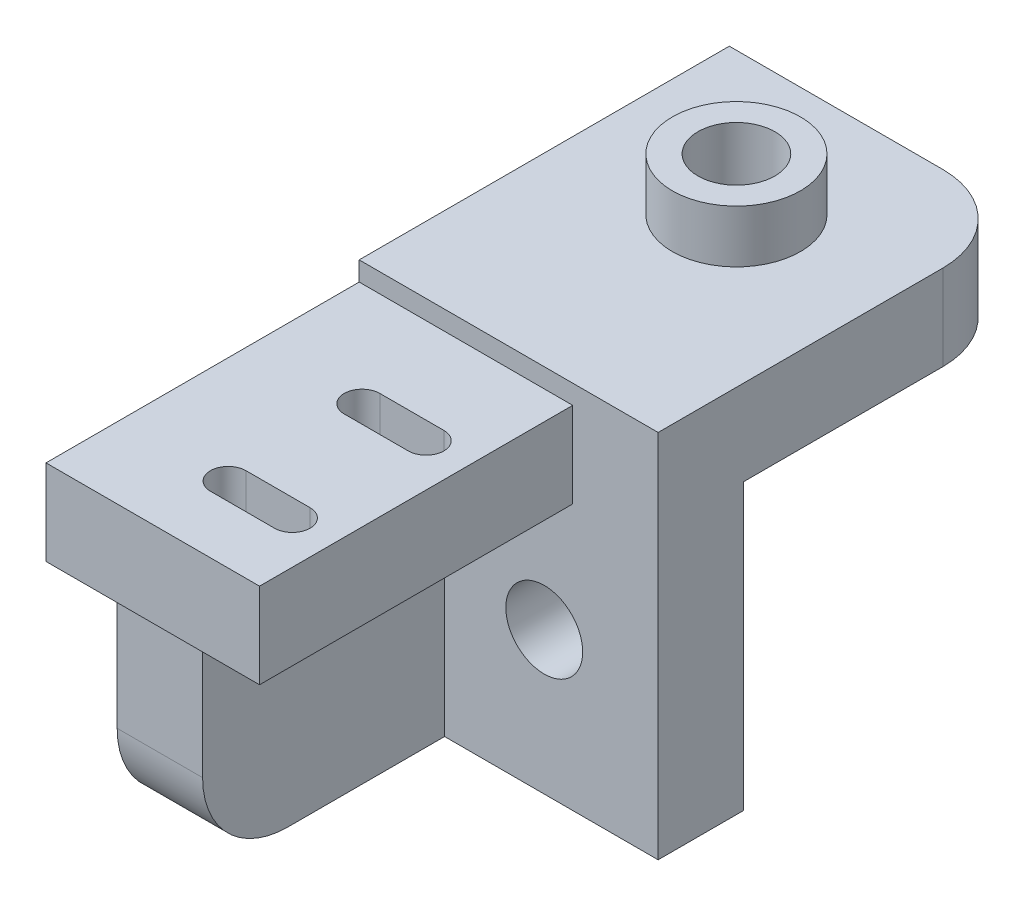
ISO-10303-21;
HEADER;
FILE_DESCRIPTION(('STEP AP214'),'2;1');
FILE_NAME('part.step','',(''),(''),'','','');
FILE_SCHEMA(('AUTOMOTIVE_DESIGN { 1 0 10303 214 1 1 1 1 }'));
ENDSEC;
DATA;
#1=APPLICATION_CONTEXT('core data for automotive mechanical design processes');
#2=APPLICATION_PROTOCOL_DEFINITION('international standard','automotive_design',2000,#1);
#3=PRODUCT_CONTEXT('',#1,'mechanical');
#4=PRODUCT('Part','Part','',(#3));
#5=PRODUCT_RELATED_PRODUCT_CATEGORY('part','',(#4));
#6=PRODUCT_DEFINITION_FORMATION('','',#4);
#7=PRODUCT_DEFINITION_CONTEXT('part definition',#1,'design');
#8=PRODUCT_DEFINITION('design','',#6,#7);
#9=PRODUCT_DEFINITION_SHAPE('','',#8);
#10=(LENGTH_UNIT() NAMED_UNIT(*) SI_UNIT(.MILLI.,.METRE.));
#11=(NAMED_UNIT(*) PLANE_ANGLE_UNIT() SI_UNIT($,.RADIAN.));
#12=(NAMED_UNIT(*) SI_UNIT($,.STERADIAN.) SOLID_ANGLE_UNIT());
#13=UNCERTAINTY_MEASURE_WITH_UNIT(LENGTH_MEASURE(1.E-05),#10,'distance_accuracy_value','');
#14=(GEOMETRIC_REPRESENTATION_CONTEXT(3) GLOBAL_UNCERTAINTY_ASSIGNED_CONTEXT((#13)) GLOBAL_UNIT_ASSIGNED_CONTEXT((#10,
#11,#12)) REPRESENTATION_CONTEXT('',''));
#15=CARTESIAN_POINT('',(0.,0.,0.));
#16=DIRECTION('',(0.,0.,1.));
#17=DIRECTION('',(1.,0.,0.));
#18=AXIS2_PLACEMENT_3D('',#15,#16,#17);
#19=CARTESIAN_POINT('',(0.,0.,6.));
#20=DIRECTION('',(0.,0.,1.));
#21=DIRECTION('',(1.,0.,0.));
#22=AXIS2_PLACEMENT_3D('',#19,#20,#21);
#23=PLANE('',#22);
#24=CARTESIAN_POINT('',(13.,10.,6.));
#25=DIRECTION('',(0.,0.,1.));
#26=DIRECTION('',(1.,0.,0.));
#27=AXIS2_PLACEMENT_3D('',#24,#25,#26);
#28=CIRCLE('',#27,2.7);
#29=CARTESIAN_POINT('',(15.7,10.,6.));
#30=VERTEX_POINT('',#29);
#31=EDGE_CURVE('E399',#30,#30,#28,.T.);
#32=ORIENTED_EDGE('',*,*,#31,.F.);
#33=EDGE_LOOP('',(#32));
#34=FACE_BOUND('',#33,.T.);
#35=DIRECTION('',(1.,0.,0.));
#36=VECTOR('',#35,1.);
#37=CARTESIAN_POINT('',(0.,18.65,6.));
#38=LINE('',#37,#36);
#39=CARTESIAN_POINT('',(6.,18.65,6.));
#40=VERTEX_POINT('',#39);
#41=CARTESIAN_POINT('',(15.,18.65,6.));
#42=VERTEX_POINT('',#41);
#43=EDGE_CURVE('E283',#40,#42,#38,.T.);
#44=ORIENTED_EDGE('',*,*,#43,.F.);
#45=DIRECTION('',(0.,1.,0.));
#46=VECTOR('',#45,1.);
#47=CARTESIAN_POINT('',(6.,0.,6.));
#48=LINE('',#47,#46);
#49=CARTESIAN_POINT('',(6.,0.,6.));
#50=VERTEX_POINT('',#49);
#51=EDGE_CURVE('E261',#50,#40,#48,.T.);
#52=ORIENTED_EDGE('',*,*,#51,.F.);
#53=DIRECTION('',(1.,0.,0.));
#54=VECTOR('',#53,1.);
#55=CARTESIAN_POINT('',(0.,0.,6.));
#56=LINE('',#55,#54);
#57=CARTESIAN_POINT('',(21.,0.,6.));
#58=VERTEX_POINT('',#57);
#59=EDGE_CURVE('E481',#50,#58,#56,.T.);
#60=ORIENTED_EDGE('',*,*,#59,.T.);
#61=DIRECTION('',(0.,1.,0.));
#62=VECTOR('',#61,1.);
#63=CARTESIAN_POINT('',(21.,0.,6.));
#64=LINE('',#63,#62);
#65=CARTESIAN_POINT('',(21.,26.,6.));
#66=VERTEX_POINT('',#65);
#67=EDGE_CURVE('E480',#58,#66,#64,.T.);
#68=ORIENTED_EDGE('',*,*,#67,.T.);
#69=DIRECTION('',(1.,0.,0.));
#70=VECTOR('',#69,1.);
#71=CARTESIAN_POINT('',(0.,26.,6.));
#72=LINE('',#71,#70);
#73=CARTESIAN_POINT('',(0.,26.,6.));
#74=VERTEX_POINT('',#73);
#75=EDGE_CURVE('E415',#74,#66,#72,.T.);
#76=ORIENTED_EDGE('',*,*,#75,.F.);
#77=DIRECTION('',(0.,1.,0.));
#78=VECTOR('',#77,1.);
#79=CARTESIAN_POINT('',(0.,0.,6.));
#80=LINE('',#79,#78);
#81=CARTESIAN_POINT('',(0.,24.65,6.));
#82=VERTEX_POINT('',#81);
#83=EDGE_CURVE('E320',#82,#74,#80,.T.);
#84=ORIENTED_EDGE('',*,*,#83,.F.);
#85=DIRECTION('',(-1.,0.,0.));
#86=VECTOR('',#85,1.);
#87=CARTESIAN_POINT('',(0.,24.65,6.));
#88=LINE('',#87,#86);
#89=CARTESIAN_POINT('',(15.,24.65,6.));
#90=VERTEX_POINT('',#89);
#91=EDGE_CURVE('E290',#90,#82,#88,.T.);
#92=ORIENTED_EDGE('',*,*,#91,.F.);
#93=DIRECTION('',(0.,1.,0.));
#94=VECTOR('',#93,1.);
#95=CARTESIAN_POINT('',(15.,24.65,6.));
#96=LINE('',#95,#94);
#97=EDGE_CURVE('E297',#42,#90,#96,.T.);
#98=ORIENTED_EDGE('',*,*,#97,.F.);
#99=EDGE_LOOP('',(#44,#52,#60,#68,#76,#84,#92,#98));
#100=FACE_BOUND('',#99,.T.);
#101=ADVANCED_FACE('F37',(#34,#100),#23,.T.);
#102=CARTESIAN_POINT('',(0.,18.65,28.));
#103=DIRECTION('',(0.,1.,0.));
#104=DIRECTION('',(0.,0.,1.));
#105=AXIS2_PLACEMENT_3D('',#102,#103,#104);
#106=PLANE('',#105);
#107=DIRECTION('',(1.,0.,0.));
#108=VECTOR('',#107,1.);
#109=CARTESIAN_POINT('',(0.,18.65,23.95));
#110=LINE('',#109,#108);
#111=CARTESIAN_POINT('',(7.5,18.65,23.95));
#112=VERTEX_POINT('',#111);
#113=CARTESIAN_POINT('',(12.,18.65,23.95));
#114=VERTEX_POINT('',#113);
#115=EDGE_CURVE('E223',#112,#114,#110,.T.);
#116=ORIENTED_EDGE('',*,*,#115,.T.);
#117=CARTESIAN_POINT('',(12.,18.65,22.7));
#118=DIRECTION('',(0.,1.,0.));
#119=DIRECTION('',(0.,0.,1.));
#120=AXIS2_PLACEMENT_3D('',#117,#118,#119);
#121=CIRCLE('',#120,1.25);
#122=CARTESIAN_POINT('',(12.,18.65,21.45));
#123=VERTEX_POINT('',#122);
#124=EDGE_CURVE('E226',#114,#123,#121,.T.);
#125=ORIENTED_EDGE('',*,*,#124,.T.);
#126=DIRECTION('',(-1.,0.,0.));
#127=VECTOR('',#126,1.);
#128=CARTESIAN_POINT('',(0.,18.65,21.45));
#129=LINE('',#128,#127);
#130=CARTESIAN_POINT('',(7.5,18.65,21.45));
#131=VERTEX_POINT('',#130);
#132=EDGE_CURVE('E218',#123,#131,#129,.T.);
#133=ORIENTED_EDGE('',*,*,#132,.T.);
#134=CARTESIAN_POINT('',(7.5,18.65,22.7));
#135=DIRECTION('',(0.,1.,0.));
#136=DIRECTION('',(0.,0.,1.));
#137=AXIS2_PLACEMENT_3D('',#134,#135,#136);
#138=CIRCLE('',#137,1.25);
#139=EDGE_CURVE('E193',#131,#112,#138,.T.);
#140=ORIENTED_EDGE('',*,*,#139,.T.);
#141=EDGE_LOOP('',(#116,#125,#133,#140));
#142=FACE_BOUND('',#141,.T.);
#143=DIRECTION('',(1.,0.,0.));
#144=VECTOR('',#143,1.);
#145=CARTESIAN_POINT('',(0.,18.65,14.55));
#146=LINE('',#145,#144);
#147=CARTESIAN_POINT('',(7.5,18.65,14.55));
#148=VERTEX_POINT('',#147);
#149=CARTESIAN_POINT('',(12.,18.65,14.55));
#150=VERTEX_POINT('',#149);
#151=EDGE_CURVE('E255',#148,#150,#146,.T.);
#152=ORIENTED_EDGE('',*,*,#151,.T.);
#153=CARTESIAN_POINT('',(12.,18.65,13.3));
#154=DIRECTION('',(0.,1.,0.));
#155=DIRECTION('',(0.,0.,1.));
#156=AXIS2_PLACEMENT_3D('',#153,#154,#155);
#157=CIRCLE('',#156,1.25);
#158=CARTESIAN_POINT('',(12.,18.65,12.05));
#159=VERTEX_POINT('',#158);
#160=EDGE_CURVE('E258',#150,#159,#157,.T.);
#161=ORIENTED_EDGE('',*,*,#160,.T.);
#162=DIRECTION('',(-1.,0.,0.));
#163=VECTOR('',#162,1.);
#164=CARTESIAN_POINT('',(0.,18.65,12.05));
#165=LINE('',#164,#163);
#166=CARTESIAN_POINT('',(7.5,18.65,12.05));
#167=VERTEX_POINT('',#166);
#168=EDGE_CURVE('E243',#159,#167,#165,.T.);
#169=ORIENTED_EDGE('',*,*,#168,.T.);
#170=CARTESIAN_POINT('',(7.5,18.65,13.3));
#171=DIRECTION('',(0.,1.,0.));
#172=DIRECTION('',(0.,0.,1.));
#173=AXIS2_PLACEMENT_3D('',#170,#171,#172);
#174=CIRCLE('',#173,1.25);
#175=EDGE_CURVE('E252',#167,#148,#174,.T.);
#176=ORIENTED_EDGE('',*,*,#175,.T.);
#177=EDGE_LOOP('',(#152,#161,#169,#176));
#178=FACE_BOUND('',#177,.T.);
#179=DIRECTION('',(0.,0.,-1.));
#180=VECTOR('',#179,1.);
#181=CARTESIAN_POINT('',(6.,18.65,23.));
#182=LINE('',#181,#180);
#183=CARTESIAN_POINT('',(6.,18.65,23.));
#184=VERTEX_POINT('',#183);
#185=EDGE_CURVE('E270',#184,#40,#182,.T.);
#186=ORIENTED_EDGE('',*,*,#185,.T.);
#187=ORIENTED_EDGE('',*,*,#43,.T.);
#188=DIRECTION('',(0.,0.,-1.));
#189=VECTOR('',#188,1.);
#190=CARTESIAN_POINT('',(15.,18.65,28.));
#191=LINE('',#190,#189);
#192=CARTESIAN_POINT('',(15.,18.65,28.));
#193=VERTEX_POINT('',#192);
#194=EDGE_CURVE('E325',#193,#42,#191,.T.);
#195=ORIENTED_EDGE('',*,*,#194,.F.);
#196=DIRECTION('',(1.,0.,0.));
#197=VECTOR('',#196,1.);
#198=CARTESIAN_POINT('',(0.,18.65,28.));
#199=LINE('',#198,#197);
#200=CARTESIAN_POINT('',(0.,18.65,28.));
#201=VERTEX_POINT('',#200);
#202=EDGE_CURVE('E289',#201,#193,#199,.T.);
#203=ORIENTED_EDGE('',*,*,#202,.F.);
#204=DIRECTION('',(0.,0.,-1.));
#205=VECTOR('',#204,1.);
#206=CARTESIAN_POINT('',(0.,18.65,28.));
#207=LINE('',#206,#205);
#208=CARTESIAN_POINT('',(0.,18.65,23.));
#209=VERTEX_POINT('',#208);
#210=EDGE_CURVE('E323',#201,#209,#207,.T.);
#211=ORIENTED_EDGE('',*,*,#210,.T.);
#212=DIRECTION('',(-1.,0.,0.));
#213=VECTOR('',#212,1.);
#214=CARTESIAN_POINT('',(0.,18.65,23.));
#215=LINE('',#214,#213);
#216=EDGE_CURVE('E267',#184,#209,#215,.T.);
#217=ORIENTED_EDGE('',*,*,#216,.F.);
#218=EDGE_LOOP('',(#186,#187,#195,#203,#211,#217));
#219=FACE_BOUND('',#218,.T.);
#220=ADVANCED_FACE('F424',(#142,#178,#219),#106,.F.);
#221=CARTESIAN_POINT('',(0.,26.,6.));
#222=DIRECTION('',(0.,1.,0.));
#223=DIRECTION('',(0.,0.,1.));
#224=AXIS2_PLACEMENT_3D('',#221,#222,#223);
#225=PLANE('',#224);
#226=DIRECTION('',(0.,0.,-1.));
#227=VECTOR('',#226,1.);
#228=CARTESIAN_POINT('',(21.,26.,6.));
#229=LINE('',#228,#227);
#230=CARTESIAN_POINT('',(21.,26.,-14.));
#231=VERTEX_POINT('',#230);
#232=EDGE_CURVE('E391',#66,#231,#229,.T.);
#233=ORIENTED_EDGE('',*,*,#232,.T.);
#234=CARTESIAN_POINT('',(15.,26.,-14.));
#235=DIRECTION('',(0.,1.,0.));
#236=DIRECTION('',(0.,0.,1.));
#237=AXIS2_PLACEMENT_3D('',#234,#235,#236);
#238=CIRCLE('',#237,6.);
#239=CARTESIAN_POINT('',(15.,26.,-20.));
#240=VERTEX_POINT('',#239);
#241=EDGE_CURVE('E11',#231,#240,#238,.T.);
#242=ORIENTED_EDGE('',*,*,#241,.T.);
#243=DIRECTION('',(1.,0.,0.));
#244=VECTOR('',#243,1.);
#245=CARTESIAN_POINT('',(21.,26.,-20.));
#246=LINE('',#245,#244);
#247=CARTESIAN_POINT('',(0.,26.,-20.));
#248=VERTEX_POINT('',#247);
#249=EDGE_CURVE('E342',#248,#240,#246,.T.);
#250=ORIENTED_EDGE('',*,*,#249,.F.);
#251=DIRECTION('',(0.,0.,-1.));
#252=VECTOR('',#251,1.);
#253=CARTESIAN_POINT('',(0.,26.,6.));
#254=LINE('',#253,#252);
#255=EDGE_CURVE('E406',#74,#248,#254,.T.);
#256=ORIENTED_EDGE('',*,*,#255,.F.);
#257=ORIENTED_EDGE('',*,*,#75,.T.);
#258=EDGE_LOOP('',(#233,#242,#250,#256,#257));
#259=FACE_BOUND('',#258,.T.);
#260=CARTESIAN_POINT('',(10.5,26.,-10.));
#261=DIRECTION('',(0.,1.,0.));
#262=DIRECTION('',(0.,0.,1.));
#263=AXIS2_PLACEMENT_3D('',#260,#261,#262);
#264=CIRCLE('',#263,4.5);
#265=CARTESIAN_POINT('',(10.5,26.,-5.5));
#266=VERTEX_POINT('',#265);
#267=EDGE_CURVE('E279',#266,#266,#264,.T.);
#268=ORIENTED_EDGE('',*,*,#267,.F.);
#269=EDGE_LOOP('',(#268));
#270=FACE_BOUND('',#269,.T.);
#271=ADVANCED_FACE('F410',(#259,#270),#225,.T.);
#272=CARTESIAN_POINT('',(0.,0.,0.));
#273=DIRECTION('',(0.,0.,1.));
#274=DIRECTION('',(1.,0.,0.));
#275=AXIS2_PLACEMENT_3D('',#272,#273,#274);
#276=PLANE('',#275);
#277=CARTESIAN_POINT('',(13.,10.,0.));
#278=DIRECTION('',(0.,0.,1.));
#279=DIRECTION('',(1.,0.,0.));
#280=AXIS2_PLACEMENT_3D('',#277,#278,#279);
#281=CIRCLE('',#280,2.7);
#282=CARTESIAN_POINT('',(15.7,10.,0.));
#283=VERTEX_POINT('',#282);
#284=EDGE_CURVE('E403',#283,#283,#281,.T.);
#285=ORIENTED_EDGE('',*,*,#284,.T.);
#286=EDGE_LOOP('',(#285));
#287=FACE_BOUND('',#286,.T.);
#288=DIRECTION('',(-1.,0.,0.));
#289=VECTOR('',#288,1.);
#290=CARTESIAN_POINT('',(21.,20.,0.));
#291=LINE('',#290,#289);
#292=CARTESIAN_POINT('',(21.,20.,0.));
#293=VERTEX_POINT('',#292);
#294=CARTESIAN_POINT('',(0.,20.,0.));
#295=VERTEX_POINT('',#294);
#296=EDGE_CURVE('E330',#293,#295,#291,.T.);
#297=ORIENTED_EDGE('',*,*,#296,.F.);
#298=DIRECTION('',(0.,1.,0.));
#299=VECTOR('',#298,1.);
#300=CARTESIAN_POINT('',(21.,0.,0.));
#301=LINE('',#300,#299);
#302=CARTESIAN_POINT('',(21.,0.,0.));
#303=VERTEX_POINT('',#302);
#304=EDGE_CURVE('E353',#303,#293,#301,.T.);
#305=ORIENTED_EDGE('',*,*,#304,.F.);
#306=DIRECTION('',(1.,0.,0.));
#307=VECTOR('',#306,1.);
#308=CARTESIAN_POINT('',(0.,0.,0.));
#309=LINE('',#308,#307);
#310=CARTESIAN_POINT('',(0.,0.,0.));
#311=VERTEX_POINT('',#310);
#312=EDGE_CURVE('E395',#311,#303,#309,.T.);
#313=ORIENTED_EDGE('',*,*,#312,.F.);
#314=DIRECTION('',(0.,1.,0.));
#315=VECTOR('',#314,1.);
#316=CARTESIAN_POINT('',(0.,0.,0.));
#317=LINE('',#316,#315);
#318=EDGE_CURVE('E365',#311,#295,#317,.T.);
#319=ORIENTED_EDGE('',*,*,#318,.T.);
#320=EDGE_LOOP('',(#297,#305,#313,#319));
#321=FACE_BOUND('',#320,.T.);
#322=ADVANCED_FACE('F438',(#287,#321),#276,.F.);
#323=CARTESIAN_POINT('',(0.,0.,6.));
#324=DIRECTION('',(-1.,0.,0.));
#325=DIRECTION('',(0.,0.,1.));
#326=AXIS2_PLACEMENT_3D('',#323,#324,#325);
#327=PLANE('',#326);
#328=DIRECTION('',(0.,0.,-1.));
#329=VECTOR('',#328,1.);
#330=CARTESIAN_POINT('',(0.,0.,6.));
#331=LINE('',#330,#329);
#332=CARTESIAN_POINT('',(0.,0.,17.));
#333=VERTEX_POINT('',#332);
#334=EDGE_CURVE('E383',#333,#311,#331,.T.);
#335=ORIENTED_EDGE('',*,*,#334,.F.);
#336=CARTESIAN_POINT('',(0.,6.,17.));
#337=DIRECTION('',(-1.,0.,0.));
#338=DIRECTION('',(0.,0.,1.));
#339=AXIS2_PLACEMENT_3D('',#336,#337,#338);
#340=CIRCLE('',#339,6.);
#341=CARTESIAN_POINT('',(0.,6.,23.));
#342=VERTEX_POINT('',#341);
#343=EDGE_CURVE('E369',#333,#342,#340,.T.);
#344=ORIENTED_EDGE('',*,*,#343,.T.);
#345=DIRECTION('',(0.,-1.,0.));
#346=VECTOR('',#345,1.);
#347=CARTESIAN_POINT('',(0.,0.,23.));
#348=LINE('',#347,#346);
#349=EDGE_CURVE('E262',#209,#342,#348,.T.);
#350=ORIENTED_EDGE('',*,*,#349,.F.);
#351=ORIENTED_EDGE('',*,*,#210,.F.);
#352=DIRECTION('',(0.,-1.,0.));
#353=VECTOR('',#352,1.);
#354=CARTESIAN_POINT('',(0.,18.65,28.));
#355=LINE('',#354,#353);
#356=CARTESIAN_POINT('',(0.,24.65,28.));
#357=VERTEX_POINT('',#356);
#358=EDGE_CURVE('E286',#357,#201,#355,.T.);
#359=ORIENTED_EDGE('',*,*,#358,.F.);
#360=DIRECTION('',(0.,0.,-1.));
#361=VECTOR('',#360,1.);
#362=CARTESIAN_POINT('',(0.,24.65,28.));
#363=LINE('',#362,#361);
#364=EDGE_CURVE('E296',#357,#82,#363,.T.);
#365=ORIENTED_EDGE('',*,*,#364,.T.);
#366=ORIENTED_EDGE('',*,*,#83,.T.);
#367=ORIENTED_EDGE('',*,*,#255,.T.);
#368=DIRECTION('',(0.,1.,0.));
#369=VECTOR('',#368,1.);
#370=CARTESIAN_POINT('',(0.,26.,-20.));
#371=LINE('',#370,#369);
#372=CARTESIAN_POINT('',(0.,20.,-20.));
#373=VERTEX_POINT('',#372);
#374=EDGE_CURVE('E339',#373,#248,#371,.T.);
#375=ORIENTED_EDGE('',*,*,#374,.F.);
#376=DIRECTION('',(0.,0.,1.));
#377=VECTOR('',#376,1.);
#378=CARTESIAN_POINT('',(0.,20.,-20.));
#379=LINE('',#378,#377);
#380=EDGE_CURVE('E345',#373,#295,#379,.T.);
#381=ORIENTED_EDGE('',*,*,#380,.T.);
#382=ORIENTED_EDGE('',*,*,#318,.F.);
#383=EDGE_LOOP('',(#335,#344,#350,#351,#359,#365,#366,#367,#375,#381,#382));
#384=FACE_BOUND('',#383,.T.);
#385=ADVANCED_FACE('F441',(#384),#327,.T.);
#386=CARTESIAN_POINT('',(0.,0.,6.));
#387=DIRECTION('',(0.,1.,0.));
#388=DIRECTION('',(0.,0.,1.));
#389=AXIS2_PLACEMENT_3D('',#386,#387,#388);
#390=PLANE('',#389);
#391=DIRECTION('',(0.,0.,-1.));
#392=VECTOR('',#391,1.);
#393=CARTESIAN_POINT('',(6.,0.,23.));
#394=LINE('',#393,#392);
#395=CARTESIAN_POINT('',(6.,0.,17.));
#396=VERTEX_POINT('',#395);
#397=EDGE_CURVE('E274',#396,#50,#394,.T.);
#398=ORIENTED_EDGE('',*,*,#397,.F.);
#399=DIRECTION('',(1.,0.,0.));
#400=VECTOR('',#399,1.);
#401=CARTESIAN_POINT('',(0.,0.,17.));
#402=LINE('',#401,#400);
#403=EDGE_CURVE('E372',#396,#333,#402,.F.);
#404=ORIENTED_EDGE('',*,*,#403,.T.);
#405=ORIENTED_EDGE('',*,*,#334,.T.);
#406=ORIENTED_EDGE('',*,*,#312,.T.);
#407=DIRECTION('',(0.,0.,-1.));
#408=VECTOR('',#407,1.);
#409=CARTESIAN_POINT('',(21.,0.,6.));
#410=LINE('',#409,#408);
#411=EDGE_CURVE('E386',#58,#303,#410,.T.);
#412=ORIENTED_EDGE('',*,*,#411,.F.);
#413=ORIENTED_EDGE('',*,*,#59,.F.);
#414=EDGE_LOOP('',(#398,#404,#405,#406,#412,#413));
#415=FACE_BOUND('',#414,.T.);
#416=ADVANCED_FACE('F452',(#415),#390,.F.);
#417=CARTESIAN_POINT('',(21.,0.,6.));
#418=DIRECTION('',(-1.,0.,0.));
#419=DIRECTION('',(0.,0.,1.));
#420=AXIS2_PLACEMENT_3D('',#417,#418,#419);
#421=PLANE('',#420);
#422=DIRECTION('',(0.,0.,1.));
#423=VECTOR('',#422,1.);
#424=CARTESIAN_POINT('',(21.,20.,-20.));
#425=LINE('',#424,#423);
#426=CARTESIAN_POINT('',(21.,20.,-14.));
#427=VERTEX_POINT('',#426);
#428=EDGE_CURVE('E358',#427,#293,#425,.T.);
#429=ORIENTED_EDGE('',*,*,#428,.F.);
#430=DIRECTION('',(0.,-1.,0.));
#431=VECTOR('',#430,1.);
#432=CARTESIAN_POINT('',(21.,26.,-14.));
#433=LINE('',#432,#431);
#434=EDGE_CURVE('E45',#427,#231,#433,.F.);
#435=ORIENTED_EDGE('',*,*,#434,.T.);
#436=ORIENTED_EDGE('',*,*,#232,.F.);
#437=ORIENTED_EDGE('',*,*,#67,.F.);
#438=ORIENTED_EDGE('',*,*,#411,.T.);
#439=ORIENTED_EDGE('',*,*,#304,.T.);
#440=EDGE_LOOP('',(#429,#435,#436,#437,#438,#439));
#441=FACE_BOUND('',#440,.T.);
#442=ADVANCED_FACE('F446',(#441),#421,.F.);
#443=CARTESIAN_POINT('',(13.,10.,6.));
#444=DIRECTION('',(0.,0.,-1.));
#445=DIRECTION('',(-1.,0.,0.));
#446=AXIS2_PLACEMENT_3D('',#443,#444,#445);
#447=CYLINDRICAL_SURFACE('',#446,2.7);
#448=ORIENTED_EDGE('',*,*,#31,.T.);
#449=EDGE_LOOP('',(#448));
#450=FACE_BOUND('',#449,.T.);
#451=ORIENTED_EDGE('',*,*,#284,.F.);
#452=EDGE_LOOP('',(#451));
#453=FACE_BOUND('',#452,.T.);
#454=ADVANCED_FACE('F443',(#450,#453),#447,.F.);
#455=CARTESIAN_POINT('',(21.,20.,-20.));
#456=DIRECTION('',(0.,1.,0.));
#457=DIRECTION('',(0.,0.,1.));
#458=AXIS2_PLACEMENT_3D('',#455,#456,#457);
#459=PLANE('',#458);
#460=CARTESIAN_POINT('',(10.5,20.,-10.));
#461=DIRECTION('',(0.,1.,0.));
#462=DIRECTION('',(0.,0.,1.));
#463=AXIS2_PLACEMENT_3D('',#460,#461,#462);
#464=CIRCLE('',#463,2.7);
#465=CARTESIAN_POINT('',(10.5,20.,-7.3));
#466=VERTEX_POINT('',#465);
#467=EDGE_CURVE('E324',#466,#466,#464,.T.);
#468=ORIENTED_EDGE('',*,*,#467,.T.);
#469=EDGE_LOOP('',(#468));
#470=FACE_BOUND('',#469,.T.);
#471=DIRECTION('',(-1.,0.,0.));
#472=VECTOR('',#471,1.);
#473=CARTESIAN_POINT('',(21.,20.,-20.));
#474=LINE('',#473,#472);
#475=CARTESIAN_POINT('',(15.,20.,-20.));
#476=VERTEX_POINT('',#475);
#477=EDGE_CURVE('E337',#476,#373,#474,.T.);
#478=ORIENTED_EDGE('',*,*,#477,.F.);
#479=CARTESIAN_POINT('',(15.,20.,-14.));
#480=DIRECTION('',(0.,1.,0.));
#481=DIRECTION('',(0.,0.,1.));
#482=AXIS2_PLACEMENT_3D('',#479,#480,#481);
#483=CIRCLE('',#482,6.);
#484=EDGE_CURVE('E59',#476,#427,#483,.F.);
#485=ORIENTED_EDGE('',*,*,#484,.T.);
#486=ORIENTED_EDGE('',*,*,#428,.T.);
#487=ORIENTED_EDGE('',*,*,#296,.T.);
#488=ORIENTED_EDGE('',*,*,#380,.F.);
#489=EDGE_LOOP('',(#478,#485,#486,#487,#488));
#490=FACE_BOUND('',#489,.T.);
#491=ADVANCED_FACE('F436',(#470,#490),#459,.F.);
#492=CARTESIAN_POINT('',(0.,0.,-20.));
#493=DIRECTION('',(0.,0.,-1.));
#494=DIRECTION('',(-1.,0.,0.));
#495=AXIS2_PLACEMENT_3D('',#492,#493,#494);
#496=PLANE('',#495);
#497=ORIENTED_EDGE('',*,*,#249,.T.);
#498=DIRECTION('',(0.,-1.,0.));
#499=VECTOR('',#498,1.);
#500=CARTESIAN_POINT('',(15.,20.,-20.));
#501=LINE('',#500,#499);
#502=EDGE_CURVE('E366',#240,#476,#501,.T.);
#503=ORIENTED_EDGE('',*,*,#502,.T.);
#504=ORIENTED_EDGE('',*,*,#477,.T.);
#505=ORIENTED_EDGE('',*,*,#374,.T.);
#506=EDGE_LOOP('',(#497,#503,#504,#505));
#507=FACE_BOUND('',#506,.T.);
#508=ADVANCED_FACE('F506',(#507),#496,.T.);
#509=CARTESIAN_POINT('',(10.5,17.,-10.));
#510=DIRECTION('',(0.,1.,0.));
#511=DIRECTION('',(0.,0.,1.));
#512=AXIS2_PLACEMENT_3D('',#509,#510,#511);
#513=CYLINDRICAL_SURFACE('',#512,2.7);
#514=CARTESIAN_POINT('',(10.5,29.7,-10.));
#515=DIRECTION('',(0.,1.,0.));
#516=DIRECTION('',(0.,0.,1.));
#517=AXIS2_PLACEMENT_3D('',#514,#515,#516);
#518=CIRCLE('',#517,2.7);
#519=CARTESIAN_POINT('',(10.5,29.7,-7.3));
#520=VERTEX_POINT('',#519);
#521=EDGE_CURVE('E276',#520,#520,#518,.T.);
#522=ORIENTED_EDGE('',*,*,#521,.T.);
#523=EDGE_LOOP('',(#522));
#524=FACE_BOUND('',#523,.T.);
#525=ORIENTED_EDGE('',*,*,#467,.F.);
#526=EDGE_LOOP('',(#525));
#527=FACE_BOUND('',#526,.T.);
#528=ADVANCED_FACE('F499',(#524,#527),#513,.F.);
#529=CARTESIAN_POINT('',(15.,24.65,28.));
#530=DIRECTION('',(-1.,0.,0.));
#531=DIRECTION('',(0.,0.,1.));
#532=AXIS2_PLACEMENT_3D('',#529,#530,#531);
#533=PLANE('',#532);
#534=ORIENTED_EDGE('',*,*,#97,.T.);
#535=DIRECTION('',(0.,0.,-1.));
#536=VECTOR('',#535,1.);
#537=CARTESIAN_POINT('',(15.,24.65,28.));
#538=LINE('',#537,#536);
#539=CARTESIAN_POINT('',(15.,24.65,28.));
#540=VERTEX_POINT('',#539);
#541=EDGE_CURVE('E302',#540,#90,#538,.T.);
#542=ORIENTED_EDGE('',*,*,#541,.F.);
#543=DIRECTION('',(0.,1.,0.));
#544=VECTOR('',#543,1.);
#545=CARTESIAN_POINT('',(15.,24.65,28.));
#546=LINE('',#545,#544);
#547=EDGE_CURVE('E292',#193,#540,#546,.T.);
#548=ORIENTED_EDGE('',*,*,#547,.F.);
#549=ORIENTED_EDGE('',*,*,#194,.T.);
#550=EDGE_LOOP('',(#534,#542,#548,#549));
#551=FACE_BOUND('',#550,.T.);
#552=ADVANCED_FACE('F497',(#551),#533,.F.);
#553=CARTESIAN_POINT('',(0.,24.65,28.));
#554=DIRECTION('',(0.,-1.,0.));
#555=DIRECTION('',(0.,0.,-1.));
#556=AXIS2_PLACEMENT_3D('',#553,#554,#555);
#557=PLANE('',#556);
#558=DIRECTION('',(-1.,0.,0.));
#559=VECTOR('',#558,1.);
#560=CARTESIAN_POINT('',(12.,24.65,21.45));
#561=LINE('',#560,#559);
#562=CARTESIAN_POINT('',(12.,24.65,21.45));
#563=VERTEX_POINT('',#562);
#564=CARTESIAN_POINT('',(7.5,24.65,21.45));
#565=VERTEX_POINT('',#564);
#566=EDGE_CURVE('E201',#563,#565,#561,.T.);
#567=ORIENTED_EDGE('',*,*,#566,.F.);
#568=CARTESIAN_POINT('',(12.,24.65,22.7));
#569=DIRECTION('',(0.,1.,0.));
#570=DIRECTION('',(0.,0.,-1.));
#571=AXIS2_PLACEMENT_3D('',#568,#569,#570);
#572=CIRCLE('',#571,1.25);
#573=CARTESIAN_POINT('',(12.,24.65,23.95));
#574=VERTEX_POINT('',#573);
#575=EDGE_CURVE('E206',#574,#563,#572,.T.);
#576=ORIENTED_EDGE('',*,*,#575,.F.);
#577=DIRECTION('',(1.,0.,0.));
#578=VECTOR('',#577,1.);
#579=CARTESIAN_POINT('',(12.,24.65,23.95));
#580=LINE('',#579,#578);
#581=CARTESIAN_POINT('',(7.5,24.65,23.95));
#582=VERTEX_POINT('',#581);
#583=EDGE_CURVE('E211',#582,#574,#580,.T.);
#584=ORIENTED_EDGE('',*,*,#583,.F.);
#585=CARTESIAN_POINT('',(7.5,24.65,22.7));
#586=DIRECTION('',(0.,1.,0.));
#587=DIRECTION('',(0.,0.,-1.));
#588=AXIS2_PLACEMENT_3D('',#585,#586,#587);
#589=CIRCLE('',#588,1.25);
#590=EDGE_CURVE('E190',#565,#582,#589,.T.);
#591=ORIENTED_EDGE('',*,*,#590,.F.);
#592=EDGE_LOOP('',(#567,#576,#584,#591));
#593=FACE_BOUND('',#592,.T.);
#594=DIRECTION('',(-1.,0.,0.));
#595=VECTOR('',#594,1.);
#596=CARTESIAN_POINT('',(12.,24.65,12.05));
#597=LINE('',#596,#595);
#598=CARTESIAN_POINT('',(12.,24.65,12.05));
#599=VERTEX_POINT('',#598);
#600=CARTESIAN_POINT('',(7.5,24.65,12.05));
#601=VERTEX_POINT('',#600);
#602=EDGE_CURVE('E231',#599,#601,#597,.T.);
#603=ORIENTED_EDGE('',*,*,#602,.F.);
#604=CARTESIAN_POINT('',(12.,24.65,13.3));
#605=DIRECTION('',(0.,1.,0.));
#606=DIRECTION('',(0.,0.,1.));
#607=AXIS2_PLACEMENT_3D('',#604,#605,#606);
#608=CIRCLE('',#607,1.25);
#609=CARTESIAN_POINT('',(12.,24.65,14.55));
#610=VERTEX_POINT('',#609);
#611=EDGE_CURVE('E229',#610,#599,#608,.T.);
#612=ORIENTED_EDGE('',*,*,#611,.F.);
#613=DIRECTION('',(1.,0.,0.));
#614=VECTOR('',#613,1.);
#615=CARTESIAN_POINT('',(12.,24.65,14.55));
#616=LINE('',#615,#614);
#617=CARTESIAN_POINT('',(7.5,24.65,14.55));
#618=VERTEX_POINT('',#617);
#619=EDGE_CURVE('E237',#618,#610,#616,.T.);
#620=ORIENTED_EDGE('',*,*,#619,.F.);
#621=CARTESIAN_POINT('',(7.5,24.65,13.3));
#622=DIRECTION('',(0.,1.,0.));
#623=DIRECTION('',(0.,0.,1.));
#624=AXIS2_PLACEMENT_3D('',#621,#622,#623);
#625=CIRCLE('',#624,1.25);
#626=EDGE_CURVE('E234',#601,#618,#625,.T.);
#627=ORIENTED_EDGE('',*,*,#626,.F.);
#628=EDGE_LOOP('',(#603,#612,#620,#627));
#629=FACE_BOUND('',#628,.T.);
#630=ORIENTED_EDGE('',*,*,#91,.T.);
#631=ORIENTED_EDGE('',*,*,#364,.F.);
#632=DIRECTION('',(-1.,0.,0.));
#633=VECTOR('',#632,1.);
#634=CARTESIAN_POINT('',(0.,24.65,28.));
#635=LINE('',#634,#633);
#636=EDGE_CURVE('E294',#540,#357,#635,.T.);
#637=ORIENTED_EDGE('',*,*,#636,.F.);
#638=ORIENTED_EDGE('',*,*,#541,.T.);
#639=EDGE_LOOP('',(#630,#631,#637,#638));
#640=FACE_BOUND('',#639,.T.);
#641=ADVANCED_FACE('F208',(#593,#629,#640),#557,.F.);
#642=CARTESIAN_POINT('',(0.,0.,28.));
#643=DIRECTION('',(0.,0.,-1.));
#644=DIRECTION('',(-1.,0.,0.));
#645=AXIS2_PLACEMENT_3D('',#642,#643,#644);
#646=PLANE('',#645);
#647=ORIENTED_EDGE('',*,*,#358,.T.);
#648=ORIENTED_EDGE('',*,*,#202,.T.);
#649=ORIENTED_EDGE('',*,*,#547,.T.);
#650=ORIENTED_EDGE('',*,*,#636,.T.);
#651=EDGE_LOOP('',(#647,#648,#649,#650));
#652=FACE_BOUND('',#651,.T.);
#653=ADVANCED_FACE('F493',(#652),#646,.F.);
#654=CARTESIAN_POINT('',(10.5,29.7,-10.));
#655=DIRECTION('',(0.,1.,0.));
#656=DIRECTION('',(0.,0.,1.));
#657=AXIS2_PLACEMENT_3D('',#654,#655,#656);
#658=PLANE('',#657);
#659=CARTESIAN_POINT('',(10.5,29.7,-10.));
#660=DIRECTION('',(0.,1.,0.));
#661=DIRECTION('',(0.,0.,1.));
#662=AXIS2_PLACEMENT_3D('',#659,#660,#661);
#663=CIRCLE('',#662,4.5);
#664=CARTESIAN_POINT('',(10.5,29.7,-5.5));
#665=VERTEX_POINT('',#664);
#666=EDGE_CURVE('E280',#665,#665,#663,.T.);
#667=ORIENTED_EDGE('',*,*,#666,.T.);
#668=EDGE_LOOP('',(#667));
#669=FACE_BOUND('',#668,.T.);
#670=ORIENTED_EDGE('',*,*,#521,.F.);
#671=EDGE_LOOP('',(#670));
#672=FACE_BOUND('',#671,.T.);
#673=ADVANCED_FACE('F655',(#669,#672),#658,.T.);
#674=CARTESIAN_POINT('',(10.5,29.7,-10.));
#675=DIRECTION('',(0.,-1.,0.));
#676=DIRECTION('',(0.,0.,-1.));
#677=AXIS2_PLACEMENT_3D('',#674,#675,#676);
#678=CYLINDRICAL_SURFACE('',#677,4.5);
#679=ORIENTED_EDGE('',*,*,#666,.F.);
#680=EDGE_LOOP('',(#679));
#681=FACE_BOUND('',#680,.T.);
#682=ORIENTED_EDGE('',*,*,#267,.T.);
#683=EDGE_LOOP('',(#682));
#684=FACE_BOUND('',#683,.T.);
#685=ADVANCED_FACE('F660',(#681,#684),#678,.T.);
#686=CARTESIAN_POINT('',(6.,0.,23.));
#687=DIRECTION('',(-1.,0.,0.));
#688=DIRECTION('',(0.,0.,1.));
#689=AXIS2_PLACEMENT_3D('',#686,#687,#688);
#690=PLANE('',#689);
#691=DIRECTION('',(0.,1.,0.));
#692=VECTOR('',#691,1.);
#693=CARTESIAN_POINT('',(6.,0.,23.));
#694=LINE('',#693,#692);
#695=CARTESIAN_POINT('',(6.,6.,23.));
#696=VERTEX_POINT('',#695);
#697=EDGE_CURVE('E265',#696,#184,#694,.T.);
#698=ORIENTED_EDGE('',*,*,#697,.F.);
#699=CARTESIAN_POINT('',(6.,6.,17.));
#700=DIRECTION('',(-1.,0.,0.));
#701=DIRECTION('',(0.,0.,1.));
#702=AXIS2_PLACEMENT_3D('',#699,#700,#701);
#703=CIRCLE('',#702,6.);
#704=EDGE_CURVE('E377',#696,#396,#703,.F.);
#705=ORIENTED_EDGE('',*,*,#704,.T.);
#706=ORIENTED_EDGE('',*,*,#397,.T.);
#707=ORIENTED_EDGE('',*,*,#51,.T.);
#708=ORIENTED_EDGE('',*,*,#185,.F.);
#709=EDGE_LOOP('',(#698,#705,#706,#707,#708));
#710=FACE_BOUND('',#709,.T.);
#711=ADVANCED_FACE('F468',(#710),#690,.F.);
#712=CARTESIAN_POINT('',(0.,0.,23.));
#713=DIRECTION('',(0.,0.,-1.));
#714=DIRECTION('',(-1.,0.,0.));
#715=AXIS2_PLACEMENT_3D('',#712,#713,#714);
#716=PLANE('',#715);
#717=ORIENTED_EDGE('',*,*,#349,.T.);
#718=DIRECTION('',(1.,0.,0.));
#719=VECTOR('',#718,1.);
#720=CARTESIAN_POINT('',(0.,6.,23.));
#721=LINE('',#720,#719);
#722=EDGE_CURVE('E316',#342,#696,#721,.T.);
#723=ORIENTED_EDGE('',*,*,#722,.T.);
#724=ORIENTED_EDGE('',*,*,#697,.T.);
#725=ORIENTED_EDGE('',*,*,#216,.T.);
#726=EDGE_LOOP('',(#717,#723,#724,#725));
#727=FACE_BOUND('',#726,.T.);
#728=ADVANCED_FACE('F459',(#727),#716,.F.);
#729=CARTESIAN_POINT('',(0.,6.,17.));
#730=DIRECTION('',(1.,0.,0.));
#731=DIRECTION('',(0.,0.,-1.));
#732=AXIS2_PLACEMENT_3D('',#729,#730,#731);
#733=CYLINDRICAL_SURFACE('',#732,6.);
#734=ORIENTED_EDGE('',*,*,#343,.F.);
#735=ORIENTED_EDGE('',*,*,#403,.F.);
#736=ORIENTED_EDGE('',*,*,#704,.F.);
#737=ORIENTED_EDGE('',*,*,#722,.F.);
#738=EDGE_LOOP('',(#734,#735,#736,#737));
#739=FACE_BOUND('',#738,.T.);
#740=ADVANCED_FACE('F456',(#739),#733,.T.);
#741=CARTESIAN_POINT('',(12.,2.65,13.3));
#742=DIRECTION('',(0.,1.,0.));
#743=DIRECTION('',(0.,0.,1.));
#744=AXIS2_PLACEMENT_3D('',#741,#742,#743);
#745=CYLINDRICAL_SURFACE('',#744,1.25);
#746=DIRECTION('',(0.,1.,0.));
#747=VECTOR('',#746,1.);
#748=CARTESIAN_POINT('',(12.,2.65,14.55));
#749=LINE('',#748,#747);
#750=EDGE_CURVE('E241',#150,#610,#749,.T.);
#751=ORIENTED_EDGE('',*,*,#750,.T.);
#752=ORIENTED_EDGE('',*,*,#611,.T.);
#753=DIRECTION('',(0.,1.,0.));
#754=VECTOR('',#753,1.);
#755=CARTESIAN_POINT('',(12.,2.65,12.05));
#756=LINE('',#755,#754);
#757=EDGE_CURVE('E240',#159,#599,#756,.T.);
#758=ORIENTED_EDGE('',*,*,#757,.F.);
#759=ORIENTED_EDGE('',*,*,#160,.F.);
#760=EDGE_LOOP('',(#751,#752,#758,#759));
#761=FACE_BOUND('',#760,.T.);
#762=ADVANCED_FACE('F458',(#761),#745,.F.);
#763=CARTESIAN_POINT('',(12.,2.65,14.55));
#764=DIRECTION('',(0.,0.,1.));
#765=DIRECTION('',(1.,0.,0.));
#766=AXIS2_PLACEMENT_3D('',#763,#764,#765);
#767=PLANE('',#766);
#768=DIRECTION('',(0.,1.,0.));
#769=VECTOR('',#768,1.);
#770=CARTESIAN_POINT('',(7.5,2.65,14.55));
#771=LINE('',#770,#769);
#772=EDGE_CURVE('E244',#148,#618,#771,.T.);
#773=ORIENTED_EDGE('',*,*,#772,.T.);
#774=ORIENTED_EDGE('',*,*,#619,.T.);
#775=ORIENTED_EDGE('',*,*,#750,.F.);
#776=ORIENTED_EDGE('',*,*,#151,.F.);
#777=EDGE_LOOP('',(#773,#774,#775,#776));
#778=FACE_BOUND('',#777,.T.);
#779=ADVANCED_FACE('F465',(#778),#767,.F.);
#780=CARTESIAN_POINT('',(7.5,2.65,13.3));
#781=DIRECTION('',(0.,1.,0.));
#782=DIRECTION('',(0.,0.,1.));
#783=AXIS2_PLACEMENT_3D('',#780,#781,#782);
#784=CYLINDRICAL_SURFACE('',#783,1.25);
#785=DIRECTION('',(0.,1.,0.));
#786=VECTOR('',#785,1.);
#787=CARTESIAN_POINT('',(7.5,2.65,12.05));
#788=LINE('',#787,#786);
#789=EDGE_CURVE('E246',#167,#601,#788,.T.);
#790=ORIENTED_EDGE('',*,*,#789,.T.);
#791=ORIENTED_EDGE('',*,*,#626,.T.);
#792=ORIENTED_EDGE('',*,*,#772,.F.);
#793=ORIENTED_EDGE('',*,*,#175,.F.);
#794=EDGE_LOOP('',(#790,#791,#792,#793));
#795=FACE_BOUND('',#794,.T.);
#796=ADVANCED_FACE('F578',(#795),#784,.F.);
#797=CARTESIAN_POINT('',(12.,2.65,12.05));
#798=DIRECTION('',(0.,0.,-1.));
#799=DIRECTION('',(-1.,0.,0.));
#800=AXIS2_PLACEMENT_3D('',#797,#798,#799);
#801=PLANE('',#800);
#802=ORIENTED_EDGE('',*,*,#757,.T.);
#803=ORIENTED_EDGE('',*,*,#602,.T.);
#804=ORIENTED_EDGE('',*,*,#789,.F.);
#805=ORIENTED_EDGE('',*,*,#168,.F.);
#806=EDGE_LOOP('',(#802,#803,#804,#805));
#807=FACE_BOUND('',#806,.T.);
#808=ADVANCED_FACE('F588',(#807),#801,.F.);
#809=CARTESIAN_POINT('',(12.,2.65,22.7));
#810=DIRECTION('',(0.,1.,0.));
#811=DIRECTION('',(0.,0.,1.));
#812=AXIS2_PLACEMENT_3D('',#809,#810,#811);
#813=CYLINDRICAL_SURFACE('',#812,1.25);
#814=DIRECTION('',(0.,1.,0.));
#815=VECTOR('',#814,1.);
#816=CARTESIAN_POINT('',(12.,2.65,23.95));
#817=LINE('',#816,#815);
#818=EDGE_CURVE('E216',#114,#574,#817,.T.);
#819=ORIENTED_EDGE('',*,*,#818,.T.);
#820=ORIENTED_EDGE('',*,*,#575,.T.);
#821=DIRECTION('',(0.,1.,0.));
#822=VECTOR('',#821,1.);
#823=CARTESIAN_POINT('',(12.,2.65,21.45));
#824=LINE('',#823,#822);
#825=EDGE_CURVE('E197',#123,#563,#824,.T.);
#826=ORIENTED_EDGE('',*,*,#825,.F.);
#827=ORIENTED_EDGE('',*,*,#124,.F.);
#828=EDGE_LOOP('',(#819,#820,#826,#827));
#829=FACE_BOUND('',#828,.T.);
#830=ADVANCED_FACE('F598',(#829),#813,.F.);
#831=CARTESIAN_POINT('',(12.,2.65,23.95));
#832=DIRECTION('',(0.,0.,1.));
#833=DIRECTION('',(1.,0.,0.));
#834=AXIS2_PLACEMENT_3D('',#831,#832,#833);
#835=PLANE('',#834);
#836=DIRECTION('',(0.,1.,0.));
#837=VECTOR('',#836,1.);
#838=CARTESIAN_POINT('',(7.5,2.65,23.95));
#839=LINE('',#838,#837);
#840=EDGE_CURVE('E196',#112,#582,#839,.T.);
#841=ORIENTED_EDGE('',*,*,#840,.T.);
#842=ORIENTED_EDGE('',*,*,#583,.T.);
#843=ORIENTED_EDGE('',*,*,#818,.F.);
#844=ORIENTED_EDGE('',*,*,#115,.F.);
#845=EDGE_LOOP('',(#841,#842,#843,#844));
#846=FACE_BOUND('',#845,.T.);
#847=ADVANCED_FACE('F608',(#846),#835,.F.);
#848=CARTESIAN_POINT('',(7.5,2.65,22.7));
#849=DIRECTION('',(0.,1.,0.));
#850=DIRECTION('',(0.,0.,1.));
#851=AXIS2_PLACEMENT_3D('',#848,#849,#850);
#852=CYLINDRICAL_SURFACE('',#851,1.25);
#853=DIRECTION('',(0.,1.,0.));
#854=VECTOR('',#853,1.);
#855=CARTESIAN_POINT('',(7.5,2.65,21.45));
#856=LINE('',#855,#854);
#857=EDGE_CURVE('E185',#131,#565,#856,.T.);
#858=ORIENTED_EDGE('',*,*,#857,.T.);
#859=ORIENTED_EDGE('',*,*,#590,.T.);
#860=ORIENTED_EDGE('',*,*,#840,.F.);
#861=ORIENTED_EDGE('',*,*,#139,.F.);
#862=EDGE_LOOP('',(#858,#859,#860,#861));
#863=FACE_BOUND('',#862,.T.);
#864=ADVANCED_FACE('F187',(#863),#852,.F.);
#865=CARTESIAN_POINT('',(12.,2.65,21.45));
#866=DIRECTION('',(0.,0.,-1.));
#867=DIRECTION('',(-1.,0.,0.));
#868=AXIS2_PLACEMENT_3D('',#865,#866,#867);
#869=PLANE('',#868);
#870=ORIENTED_EDGE('',*,*,#825,.T.);
#871=ORIENTED_EDGE('',*,*,#566,.T.);
#872=ORIENTED_EDGE('',*,*,#857,.F.);
#873=ORIENTED_EDGE('',*,*,#132,.F.);
#874=EDGE_LOOP('',(#870,#871,#872,#873));
#875=FACE_BOUND('',#874,.T.);
#876=ADVANCED_FACE('F202',(#875),#869,.F.);
#877=CARTESIAN_POINT('',(15.,0.,-14.));
#878=DIRECTION('',(0.,1.,0.));
#879=DIRECTION('',(0.,0.,1.));
#880=AXIS2_PLACEMENT_3D('',#877,#878,#879);
#881=CYLINDRICAL_SURFACE('',#880,6.);
#882=ORIENTED_EDGE('',*,*,#241,.F.);
#883=ORIENTED_EDGE('',*,*,#434,.F.);
#884=ORIENTED_EDGE('',*,*,#484,.F.);
#885=ORIENTED_EDGE('',*,*,#502,.F.);
#886=EDGE_LOOP('',(#882,#883,#884,#885));
#887=FACE_BOUND('',#886,.T.);
#888=ADVANCED_FACE('F39',(#887),#881,.T.);
#889=CLOSED_SHELL('',(#101,#220,#271,#322,#385,#416,#442,#454,#491,#508,#528,#552,#641,#653,
#673,#685,#711,#728,#740,#762,#779,#796,#808,#830,#847,#864,#876,#888));
#890=MANIFOLD_SOLID_BREP('B2',#889);
#891=ADVANCED_BREP_SHAPE_REPRESENTATION('',(#18,#890),#14);
#892=SHAPE_DEFINITION_REPRESENTATION(#9,#891);
ENDSEC;
END-ISO-10303-21;
